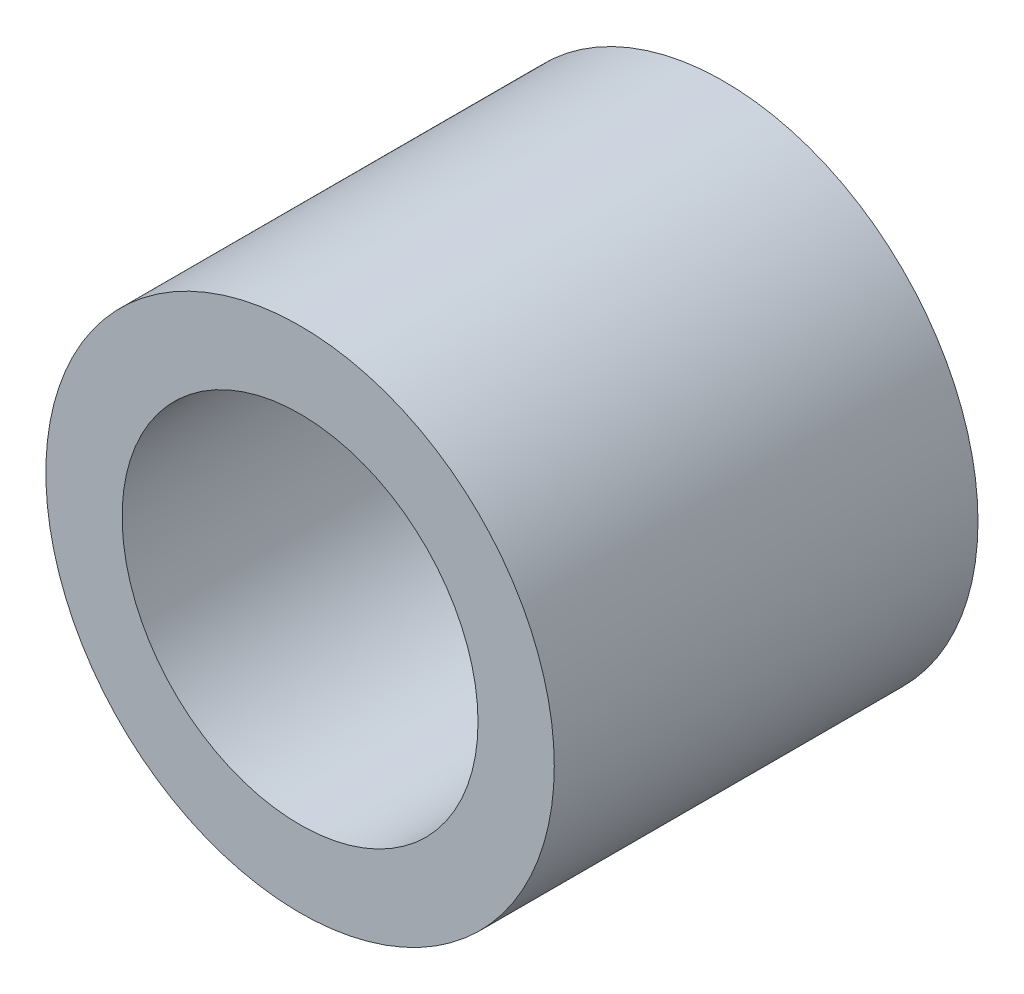
ISO-10303-21;
HEADER;
FILE_DESCRIPTION(('STEP AP214'),'2;1');
FILE_NAME('part.step','',(''),(''),'','','');
FILE_SCHEMA(('AUTOMOTIVE_DESIGN { 1 0 10303 214 1 1 1 1 }'));
ENDSEC;
DATA;
#1=APPLICATION_CONTEXT('core data for automotive mechanical design processes');
#2=APPLICATION_PROTOCOL_DEFINITION('international standard','automotive_design',2000,#1);
#3=PRODUCT_CONTEXT('',#1,'mechanical');
#4=PRODUCT('Part','Part','',(#3));
#5=PRODUCT_RELATED_PRODUCT_CATEGORY('part','',(#4));
#6=PRODUCT_DEFINITION_FORMATION('','',#4);
#7=PRODUCT_DEFINITION_CONTEXT('part definition',#1,'design');
#8=PRODUCT_DEFINITION('design','',#6,#7);
#9=PRODUCT_DEFINITION_SHAPE('','',#8);
#10=(LENGTH_UNIT() NAMED_UNIT(*) SI_UNIT(.MILLI.,.METRE.));
#11=(NAMED_UNIT(*) PLANE_ANGLE_UNIT() SI_UNIT($,.RADIAN.));
#12=(NAMED_UNIT(*) SI_UNIT($,.STERADIAN.) SOLID_ANGLE_UNIT());
#13=UNCERTAINTY_MEASURE_WITH_UNIT(LENGTH_MEASURE(1.E-05),#10,'distance_accuracy_value','');
#14=(GEOMETRIC_REPRESENTATION_CONTEXT(3) GLOBAL_UNCERTAINTY_ASSIGNED_CONTEXT((#13)) GLOBAL_UNIT_ASSIGNED_CONTEXT((#10,
#11,#12)) REPRESENTATION_CONTEXT('',''));
#15=CARTESIAN_POINT('',(0.,0.,0.));
#16=DIRECTION('',(0.,0.,1.));
#17=DIRECTION('',(1.,0.,0.));
#18=AXIS2_PLACEMENT_3D('',#15,#16,#17);
#19=CARTESIAN_POINT('',(0.,0.,5.));
#20=DIRECTION('',(0.,0.,1.));
#21=DIRECTION('',(1.,0.,0.));
#22=AXIS2_PLACEMENT_3D('',#19,#20,#21);
#23=PLANE('',#22);
#24=CARTESIAN_POINT('',(0.,0.,5.));
#25=DIRECTION('',(0.,0.,1.));
#26=DIRECTION('',(1.,0.,0.));
#27=AXIS2_PLACEMENT_3D('',#24,#25,#26);
#28=CIRCLE('',#27,3.);
#29=CARTESIAN_POINT('',(3.,0.,5.));
#30=VERTEX_POINT('',#29);
#31=EDGE_CURVE('E10',#30,#30,#28,.T.);
#32=ORIENTED_EDGE('',*,*,#31,.T.);
#33=EDGE_LOOP('',(#32));
#34=FACE_BOUND('',#33,.T.);
#35=CARTESIAN_POINT('',(0.,0.,5.));
#36=DIRECTION('',(0.,0.,1.));
#37=DIRECTION('',(1.,0.,0.));
#38=AXIS2_PLACEMENT_3D('',#35,#36,#37);
#39=CIRCLE('',#38,2.1);
#40=CARTESIAN_POINT('',(2.1,0.,5.));
#41=VERTEX_POINT('',#40);
#42=EDGE_CURVE('E50',#41,#41,#39,.T.);
#43=ORIENTED_EDGE('',*,*,#42,.F.);
#44=EDGE_LOOP('',(#43));
#45=FACE_BOUND('',#44,.T.);
#46=ADVANCED_FACE('F37',(#34,#45),#23,.T.);
#47=CARTESIAN_POINT('',(0.,0.,0.));
#48=DIRECTION('',(0.,0.,1.));
#49=DIRECTION('',(1.,0.,0.));
#50=AXIS2_PLACEMENT_3D('',#47,#48,#49);
#51=PLANE('',#50);
#52=CARTESIAN_POINT('',(0.,0.,0.));
#53=DIRECTION('',(0.,0.,1.));
#54=DIRECTION('',(1.,0.,0.));
#55=AXIS2_PLACEMENT_3D('',#52,#53,#54);
#56=CIRCLE('',#55,3.);
#57=CARTESIAN_POINT('',(3.,0.,0.));
#58=VERTEX_POINT('',#57);
#59=EDGE_CURVE('E41',#58,#58,#56,.T.);
#60=ORIENTED_EDGE('',*,*,#59,.F.);
#61=EDGE_LOOP('',(#60));
#62=FACE_BOUND('',#61,.T.);
#63=CARTESIAN_POINT('',(0.,0.,0.));
#64=DIRECTION('',(0.,0.,1.));
#65=DIRECTION('',(1.,0.,0.));
#66=AXIS2_PLACEMENT_3D('',#63,#64,#65);
#67=CIRCLE('',#66,2.1);
#68=CARTESIAN_POINT('',(2.1,0.,0.));
#69=VERTEX_POINT('',#68);
#70=EDGE_CURVE('E52',#69,#69,#67,.T.);
#71=ORIENTED_EDGE('',*,*,#70,.T.);
#72=EDGE_LOOP('',(#71));
#73=FACE_BOUND('',#72,.T.);
#74=ADVANCED_FACE('F64',(#62,#73),#51,.F.);
#75=CARTESIAN_POINT('',(0.,0.,5.));
#76=DIRECTION('',(0.,0.,-1.));
#77=DIRECTION('',(-1.,0.,0.));
#78=AXIS2_PLACEMENT_3D('',#75,#76,#77);
#79=CYLINDRICAL_SURFACE('',#78,3.);
#80=ORIENTED_EDGE('',*,*,#31,.F.);
#81=EDGE_LOOP('',(#80));
#82=FACE_BOUND('',#81,.T.);
#83=ORIENTED_EDGE('',*,*,#59,.T.);
#84=EDGE_LOOP('',(#83));
#85=FACE_BOUND('',#84,.T.);
#86=ADVANCED_FACE('F39',(#82,#85),#79,.T.);
#87=CARTESIAN_POINT('',(0.,0.,5.));
#88=DIRECTION('',(0.,0.,-1.));
#89=DIRECTION('',(-1.,0.,0.));
#90=AXIS2_PLACEMENT_3D('',#87,#88,#89);
#91=CYLINDRICAL_SURFACE('',#90,2.1);
#92=ORIENTED_EDGE('',*,*,#42,.T.);
#93=EDGE_LOOP('',(#92));
#94=FACE_BOUND('',#93,.T.);
#95=ORIENTED_EDGE('',*,*,#70,.F.);
#96=EDGE_LOOP('',(#95));
#97=FACE_BOUND('',#96,.T.);
#98=ADVANCED_FACE('F60',(#94,#97),#91,.F.);
#99=CLOSED_SHELL('',(#46,#74,#86,#98));
#100=MANIFOLD_SOLID_BREP('B2',#99);
#101=ADVANCED_BREP_SHAPE_REPRESENTATION('',(#18,#100),#14);
#102=SHAPE_DEFINITION_REPRESENTATION(#9,#101);
ENDSEC;
END-ISO-10303-21;
